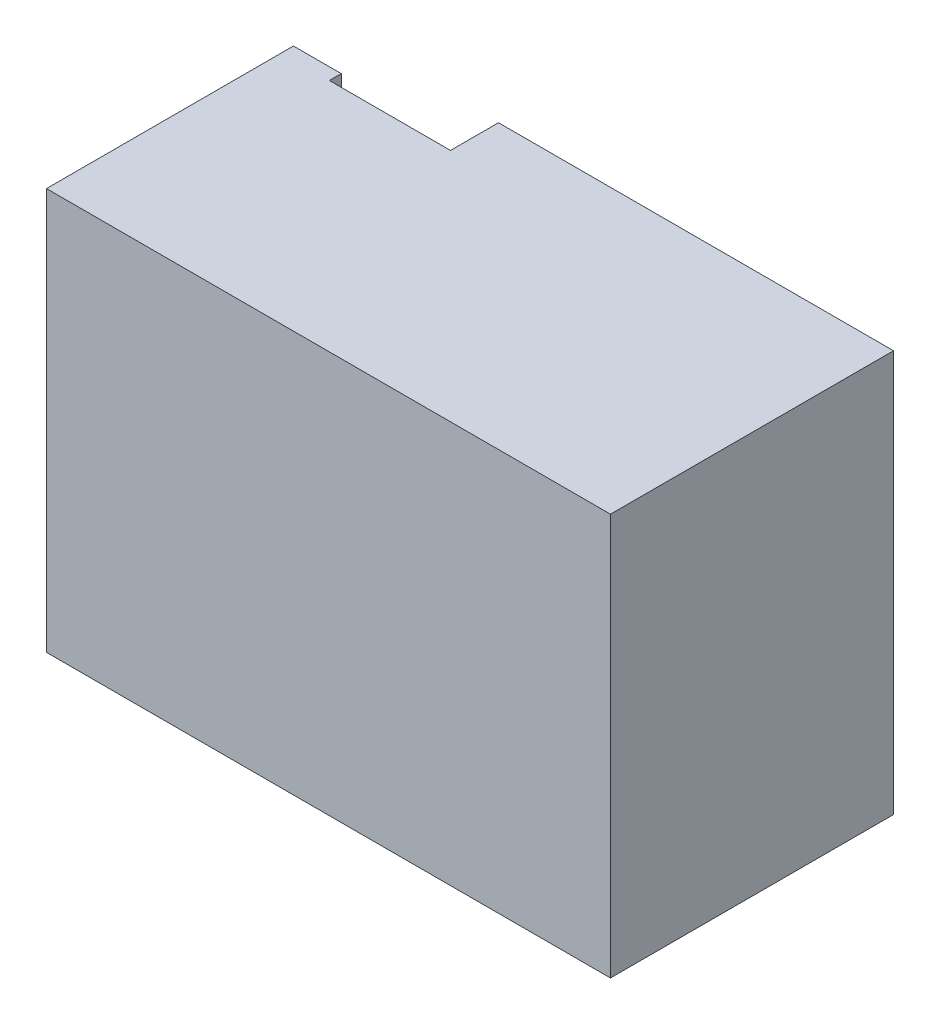
ISO-10303-21;
HEADER;
FILE_DESCRIPTION(('STEP AP214'),'2;1');
FILE_NAME('part.step','',(''),(''),'','','');
FILE_SCHEMA(('AUTOMOTIVE_DESIGN { 1 0 10303 214 1 1 1 1 }'));
ENDSEC;
DATA;
#1=APPLICATION_CONTEXT('core data for automotive mechanical design processes');
#2=APPLICATION_PROTOCOL_DEFINITION('international standard','automotive_design',2000,#1);
#3=PRODUCT_CONTEXT('',#1,'mechanical');
#4=PRODUCT('Part','Part','',(#3));
#5=PRODUCT_RELATED_PRODUCT_CATEGORY('part','',(#4));
#6=PRODUCT_DEFINITION_FORMATION('','',#4);
#7=PRODUCT_DEFINITION_CONTEXT('part definition',#1,'design');
#8=PRODUCT_DEFINITION('design','',#6,#7);
#9=PRODUCT_DEFINITION_SHAPE('','',#8);
#10=(LENGTH_UNIT() NAMED_UNIT(*) SI_UNIT(.MILLI.,.METRE.));
#11=(NAMED_UNIT(*) PLANE_ANGLE_UNIT() SI_UNIT($,.RADIAN.));
#12=(NAMED_UNIT(*) SI_UNIT($,.STERADIAN.) SOLID_ANGLE_UNIT());
#13=UNCERTAINTY_MEASURE_WITH_UNIT(LENGTH_MEASURE(1.E-05),#10,'distance_accuracy_value','');
#14=(GEOMETRIC_REPRESENTATION_CONTEXT(3) GLOBAL_UNCERTAINTY_ASSIGNED_CONTEXT((#13)) GLOBAL_UNIT_ASSIGNED_CONTEXT((#10,
#11,#12)) REPRESENTATION_CONTEXT('',''));
#15=CARTESIAN_POINT('',(0.,0.,0.));
#16=DIRECTION('',(0.,0.,1.));
#17=DIRECTION('',(1.,0.,0.));
#18=AXIS2_PLACEMENT_3D('',#15,#16,#17);
#19=CARTESIAN_POINT('',(72.306268293715,-48.3210427553595,43.5923082751366));
#20=DIRECTION('',(-1.,0.,0.));
#21=DIRECTION('',(0.,0.,1.));
#22=AXIS2_PLACEMENT_3D('',#19,#20,#21);
#23=PLANE('',#22);
#24=DIRECTION('',(0.,0.,-1.));
#25=VECTOR('',#24,1.);
#26=CARTESIAN_POINT('',(72.306268293715,59.6789572446405,43.5923082751366));
#27=LINE('',#26,#25);
#28=CARTESIAN_POINT('',(72.306268293715,59.6789572446405,81.5923082751366));
#29=VERTEX_POINT('',#28);
#30=CARTESIAN_POINT('',(72.306268293715,59.6789572446405,5.49230827513662));
#31=VERTEX_POINT('',#30);
#32=EDGE_CURVE('E11',#29,#31,#27,.T.);
#33=ORIENTED_EDGE('',*,*,#32,.F.);
#34=DIRECTION('',(0.,1.,0.));
#35=VECTOR('',#34,1.);
#36=CARTESIAN_POINT('',(72.306268293715,-48.3210427553595,81.5923082751366));
#37=LINE('',#36,#35);
#38=CARTESIAN_POINT('',(72.306268293715,-48.3210427553595,81.5923082751366));
#39=VERTEX_POINT('',#38);
#40=EDGE_CURVE('E98',#39,#29,#37,.T.);
#41=ORIENTED_EDGE('',*,*,#40,.F.);
#42=DIRECTION('',(0.,0.,-1.));
#43=VECTOR('',#42,1.);
#44=CARTESIAN_POINT('',(72.306268293715,-48.3210427553595,43.5923082751366));
#45=LINE('',#44,#43);
#46=CARTESIAN_POINT('',(72.306268293715,-48.3210427553595,5.49230827513662));
#47=VERTEX_POINT('',#46);
#48=EDGE_CURVE('E55',#39,#47,#45,.T.);
#49=ORIENTED_EDGE('',*,*,#48,.T.);
#50=DIRECTION('',(0.,1.,0.));
#51=VECTOR('',#50,1.);
#52=CARTESIAN_POINT('',(72.306268293715,-48.3210427553595,5.49230827513662));
#53=LINE('',#52,#51);
#54=EDGE_CURVE('E100',#47,#31,#53,.T.);
#55=ORIENTED_EDGE('',*,*,#54,.T.);
#56=EDGE_LOOP('',(#33,#41,#49,#55));
#57=FACE_BOUND('',#56,.T.);
#58=ADVANCED_FACE('F31',(#57),#23,.F.);
#59=CARTESIAN_POINT('',(72.306268293715,59.6789572446405,43.5923082751366));
#60=DIRECTION('',(0.,-1.,0.));
#61=DIRECTION('',(0.,0.,-1.));
#62=AXIS2_PLACEMENT_3D('',#59,#60,#61);
#63=PLANE('',#62);
#64=DIRECTION('',(0.,0.,-1.));
#65=VECTOR('',#64,1.);
#66=CARTESIAN_POINT('',(-79.3237317062851,59.6789572446405,43.5923082751366));
#67=LINE('',#66,#65);
#68=CARTESIAN_POINT('',(-79.3237317062851,59.6789572446405,81.5923082751366));
#69=VERTEX_POINT('',#68);
#70=CARTESIAN_POINT('',(-79.3237317062851,59.6789572446405,15.2023082751366));
#71=VERTEX_POINT('',#70);
#72=EDGE_CURVE('E108',#69,#71,#67,.T.);
#73=ORIENTED_EDGE('',*,*,#72,.F.);
#74=DIRECTION('',(-1.,0.,0.));
#75=VECTOR('',#74,1.);
#76=CARTESIAN_POINT('',(72.306268293715,59.6789572446405,81.5923082751366));
#77=LINE('',#76,#75);
#78=EDGE_CURVE('E105',#29,#69,#77,.T.);
#79=ORIENTED_EDGE('',*,*,#78,.F.);
#80=ORIENTED_EDGE('',*,*,#32,.T.);
#81=DIRECTION('',(-1.,0.,0.));
#82=VECTOR('',#81,1.);
#83=CARTESIAN_POINT('',(72.306268293715,59.6789572446405,5.49230827513662));
#84=LINE('',#83,#82);
#85=CARTESIAN_POINT('',(-33.8937317062851,59.6789572446405,5.49230827513662));
#86=VERTEX_POINT('',#85);
#87=EDGE_CURVE('E157',#31,#86,#84,.T.);
#88=ORIENTED_EDGE('',*,*,#87,.T.);
#89=DIRECTION('',(0.,0.,-1.));
#90=VECTOR('',#89,1.);
#91=CARTESIAN_POINT('',(-33.8937317062851,59.6789572446405,43.5923082751366));
#92=LINE('',#91,#90);
#93=CARTESIAN_POINT('',(-33.8937317062851,59.6789572446405,18.4023082751366));
#94=VERTEX_POINT('',#93);
#95=EDGE_CURVE('E40',#94,#86,#92,.T.);
#96=ORIENTED_EDGE('',*,*,#95,.F.);
#97=DIRECTION('',(1.,0.,0.));
#98=VECTOR('',#97,1.);
#99=CARTESIAN_POINT('',(-79.3237317062851,59.6789572446405,18.4023082751366));
#100=LINE('',#99,#98);
#101=CARTESIAN_POINT('',(-66.4637317062851,59.6789572446405,18.4023082751366));
#102=VERTEX_POINT('',#101);
#103=EDGE_CURVE('E34',#102,#94,#100,.T.);
#104=ORIENTED_EDGE('',*,*,#103,.F.);
#105=DIRECTION('',(0.,0.,1.));
#106=VECTOR('',#105,1.);
#107=CARTESIAN_POINT('',(-66.4637317062851,59.6789572446405,15.2023082751366));
#108=LINE('',#107,#106);
#109=CARTESIAN_POINT('',(-66.4637317062851,59.6789572446405,15.2023082751366));
#110=VERTEX_POINT('',#109);
#111=EDGE_CURVE('E137',#110,#102,#108,.T.);
#112=ORIENTED_EDGE('',*,*,#111,.F.);
#113=DIRECTION('',(1.,0.,0.));
#114=VECTOR('',#113,1.);
#115=CARTESIAN_POINT('',(-79.3237317062851,59.6789572446405,15.2023082751366));
#116=LINE('',#115,#114);
#117=EDGE_CURVE('E126',#71,#110,#116,.T.);
#118=ORIENTED_EDGE('',*,*,#117,.F.);
#119=EDGE_LOOP('',(#73,#79,#80,#88,#96,#104,#112,#118));
#120=FACE_BOUND('',#119,.T.);
#121=ADVANCED_FACE('F106',(#120),#63,.F.);
#122=CARTESIAN_POINT('',(72.306268293715,-48.3210427553595,43.5923082751366));
#123=DIRECTION('',(0.,1.,0.));
#124=DIRECTION('',(0.,0.,1.));
#125=AXIS2_PLACEMENT_3D('',#122,#123,#124);
#126=PLANE('',#125);
#127=ORIENTED_EDGE('',*,*,#48,.F.);
#128=DIRECTION('',(1.,0.,0.));
#129=VECTOR('',#128,1.);
#130=CARTESIAN_POINT('',(72.306268293715,-48.3210427553595,81.5923082751366));
#131=LINE('',#130,#129);
#132=CARTESIAN_POINT('',(-79.3237317062851,-48.3210427553595,81.5923082751366));
#133=VERTEX_POINT('',#132);
#134=EDGE_CURVE('E117',#133,#39,#131,.T.);
#135=ORIENTED_EDGE('',*,*,#134,.F.);
#136=DIRECTION('',(0.,0.,1.));
#137=VECTOR('',#136,1.);
#138=CARTESIAN_POINT('',(-79.3237317062851,-48.3210427553595,43.5923082751366));
#139=LINE('',#138,#137);
#140=CARTESIAN_POINT('',(-79.3237317062851,-48.3210427553595,15.2023082751366));
#141=VERTEX_POINT('',#140);
#142=EDGE_CURVE('E141',#141,#133,#139,.T.);
#143=ORIENTED_EDGE('',*,*,#142,.F.);
#144=DIRECTION('',(-1.,0.,0.));
#145=VECTOR('',#144,1.);
#146=CARTESIAN_POINT('',(-79.3237317062851,-48.3210427553595,15.2023082751366));
#147=LINE('',#146,#145);
#148=CARTESIAN_POINT('',(-66.4637317062851,-48.3210427553595,15.2023082751366));
#149=VERTEX_POINT('',#148);
#150=EDGE_CURVE('E130',#149,#141,#147,.T.);
#151=ORIENTED_EDGE('',*,*,#150,.F.);
#152=DIRECTION('',(0.,0.,1.));
#153=VECTOR('',#152,1.);
#154=CARTESIAN_POINT('',(-66.4637317062851,-48.3210427553595,15.2023082751366));
#155=LINE('',#154,#153);
#156=CARTESIAN_POINT('',(-66.4637317062851,-48.3210427553595,18.4023082751366));
#157=VERTEX_POINT('',#156);
#158=EDGE_CURVE('E133',#149,#157,#155,.T.);
#159=ORIENTED_EDGE('',*,*,#158,.T.);
#160=DIRECTION('',(1.,0.,0.));
#161=VECTOR('',#160,1.);
#162=CARTESIAN_POINT('',(-79.3237317062851,-48.3210427553595,18.4023082751366));
#163=LINE('',#162,#161);
#164=CARTESIAN_POINT('',(-33.8937317062851,-48.3210427553595,18.4023082751366));
#165=VERTEX_POINT('',#164);
#166=EDGE_CURVE('E143',#157,#165,#163,.T.);
#167=ORIENTED_EDGE('',*,*,#166,.T.);
#168=DIRECTION('',(0.,0.,-1.));
#169=VECTOR('',#168,1.);
#170=CARTESIAN_POINT('',(-33.8937317062851,-48.3210427553595,43.5923082751366));
#171=LINE('',#170,#169);
#172=CARTESIAN_POINT('',(-33.8937317062851,-48.3210427553595,5.49230827513662));
#173=VERTEX_POINT('',#172);
#174=EDGE_CURVE('E167',#165,#173,#171,.T.);
#175=ORIENTED_EDGE('',*,*,#174,.T.);
#176=DIRECTION('',(1.,0.,0.));
#177=VECTOR('',#176,1.);
#178=CARTESIAN_POINT('',(72.306268293715,-48.3210427553595,5.49230827513662));
#179=LINE('',#178,#177);
#180=EDGE_CURVE('E162',#173,#47,#179,.T.);
#181=ORIENTED_EDGE('',*,*,#180,.T.);
#182=EDGE_LOOP('',(#127,#135,#143,#151,#159,#167,#175,#181));
#183=FACE_BOUND('',#182,.T.);
#184=ADVANCED_FACE('F184',(#183),#126,.F.);
#185=CARTESIAN_POINT('',(-79.3237317062851,59.6789572446405,43.5923082751366));
#186=DIRECTION('',(-1.,0.,0.));
#187=DIRECTION('',(0.,0.,1.));
#188=AXIS2_PLACEMENT_3D('',#185,#186,#187);
#189=PLANE('',#188);
#190=ORIENTED_EDGE('',*,*,#142,.T.);
#191=DIRECTION('',(0.,-1.,0.));
#192=VECTOR('',#191,1.);
#193=CARTESIAN_POINT('',(-79.3237317062851,-48.3210427553595,81.5923082751366));
#194=LINE('',#193,#192);
#195=EDGE_CURVE('E112',#69,#133,#194,.T.);
#196=ORIENTED_EDGE('',*,*,#195,.F.);
#197=ORIENTED_EDGE('',*,*,#72,.T.);
#198=DIRECTION('',(0.,1.,0.));
#199=VECTOR('',#198,1.);
#200=CARTESIAN_POINT('',(-79.3237317062851,-48.3210427553595,15.2023082751366));
#201=LINE('',#200,#199);
#202=EDGE_CURVE('E123',#141,#71,#201,.T.);
#203=ORIENTED_EDGE('',*,*,#202,.F.);
#204=EDGE_LOOP('',(#190,#196,#197,#203));
#205=FACE_BOUND('',#204,.T.);
#206=ADVANCED_FACE('F183',(#205),#189,.T.);
#207=CARTESIAN_POINT('',(-79.3237317062851,-48.3210427553595,18.4023082751366));
#208=DIRECTION('',(0.,0.,1.));
#209=DIRECTION('',(1.,0.,0.));
#210=AXIS2_PLACEMENT_3D('',#207,#208,#209);
#211=PLANE('',#210);
#212=DIRECTION('',(0.,-1.,0.));
#213=VECTOR('',#212,1.);
#214=CARTESIAN_POINT('',(-66.4637317062851,-48.3210427553595,18.4023082751366));
#215=LINE('',#214,#213);
#216=EDGE_CURVE('E122',#102,#157,#215,.T.);
#217=ORIENTED_EDGE('',*,*,#216,.F.);
#218=ORIENTED_EDGE('',*,*,#103,.T.);
#219=DIRECTION('',(0.,-1.,0.));
#220=VECTOR('',#219,1.);
#221=CARTESIAN_POINT('',(-33.8937317062851,-48.3210427553595,18.4023082751366));
#222=LINE('',#221,#220);
#223=EDGE_CURVE('E139',#94,#165,#222,.T.);
#224=ORIENTED_EDGE('',*,*,#223,.T.);
#225=ORIENTED_EDGE('',*,*,#166,.F.);
#226=EDGE_LOOP('',(#217,#218,#224,#225));
#227=FACE_BOUND('',#226,.T.);
#228=ADVANCED_FACE('F194',(#227),#211,.F.);
#229=CARTESIAN_POINT('',(-33.8937317062851,-48.3210427553595,43.5923082751366));
#230=DIRECTION('',(1.,0.,0.));
#231=DIRECTION('',(0.,0.,-1.));
#232=AXIS2_PLACEMENT_3D('',#229,#230,#231);
#233=PLANE('',#232);
#234=ORIENTED_EDGE('',*,*,#223,.F.);
#235=ORIENTED_EDGE('',*,*,#95,.T.);
#236=DIRECTION('',(0.,-1.,0.));
#237=VECTOR('',#236,1.);
#238=CARTESIAN_POINT('',(-33.8937317062851,-48.3210427553595,5.49230827513662));
#239=LINE('',#238,#237);
#240=EDGE_CURVE('E158',#86,#173,#239,.T.);
#241=ORIENTED_EDGE('',*,*,#240,.T.);
#242=ORIENTED_EDGE('',*,*,#174,.F.);
#243=EDGE_LOOP('',(#234,#235,#241,#242));
#244=FACE_BOUND('',#243,.T.);
#245=ADVANCED_FACE('F171',(#244),#233,.F.);
#246=CARTESIAN_POINT('',(72.306268293715,59.6789572446405,5.49230827513662));
#247=DIRECTION('',(0.,0.,1.));
#248=DIRECTION('',(1.,0.,0.));
#249=AXIS2_PLACEMENT_3D('',#246,#247,#248);
#250=PLANE('',#249);
#251=ORIENTED_EDGE('',*,*,#54,.F.);
#252=ORIENTED_EDGE('',*,*,#180,.F.);
#253=ORIENTED_EDGE('',*,*,#240,.F.);
#254=ORIENTED_EDGE('',*,*,#87,.F.);
#255=EDGE_LOOP('',(#251,#252,#253,#254));
#256=FACE_BOUND('',#255,.T.);
#257=ADVANCED_FACE('F186',(#256),#250,.F.);
#258=CARTESIAN_POINT('',(-66.4637317062851,-48.3210427553595,15.2023082751366));
#259=DIRECTION('',(-1.,0.,0.));
#260=DIRECTION('',(0.,0.,1.));
#261=AXIS2_PLACEMENT_3D('',#258,#259,#260);
#262=PLANE('',#261);
#263=ORIENTED_EDGE('',*,*,#216,.T.);
#264=ORIENTED_EDGE('',*,*,#158,.F.);
#265=DIRECTION('',(0.,-1.,0.));
#266=VECTOR('',#265,1.);
#267=CARTESIAN_POINT('',(-66.4637317062851,-48.3210427553595,15.2023082751366));
#268=LINE('',#267,#266);
#269=EDGE_CURVE('E128',#110,#149,#268,.T.);
#270=ORIENTED_EDGE('',*,*,#269,.F.);
#271=ORIENTED_EDGE('',*,*,#111,.T.);
#272=EDGE_LOOP('',(#263,#264,#270,#271));
#273=FACE_BOUND('',#272,.T.);
#274=ADVANCED_FACE('F177',(#273),#262,.F.);
#275=CARTESIAN_POINT('',(-79.3237317062851,59.6789572446405,15.2023082751366));
#276=DIRECTION('',(0.,0.,-1.));
#277=DIRECTION('',(-1.,0.,0.));
#278=AXIS2_PLACEMENT_3D('',#275,#276,#277);
#279=PLANE('',#278);
#280=ORIENTED_EDGE('',*,*,#202,.T.);
#281=ORIENTED_EDGE('',*,*,#117,.T.);
#282=ORIENTED_EDGE('',*,*,#269,.T.);
#283=ORIENTED_EDGE('',*,*,#150,.T.);
#284=EDGE_LOOP('',(#280,#281,#282,#283));
#285=FACE_BOUND('',#284,.T.);
#286=ADVANCED_FACE('F180',(#285),#279,.T.);
#287=CARTESIAN_POINT('',(72.306268293715,59.6789572446405,81.5923082751366));
#288=DIRECTION('',(0.,0.,1.));
#289=DIRECTION('',(1.,0.,0.));
#290=AXIS2_PLACEMENT_3D('',#287,#288,#289);
#291=PLANE('',#290);
#292=ORIENTED_EDGE('',*,*,#40,.T.);
#293=ORIENTED_EDGE('',*,*,#78,.T.);
#294=ORIENTED_EDGE('',*,*,#195,.T.);
#295=ORIENTED_EDGE('',*,*,#134,.T.);
#296=EDGE_LOOP('',(#292,#293,#294,#295));
#297=FACE_BOUND('',#296,.T.);
#298=ADVANCED_FACE('F115',(#297),#291,.T.);
#299=CLOSED_SHELL('',(#58,#121,#184,#206,#228,#245,#257,#274,#286,#298));
#300=MANIFOLD_SOLID_BREP('B2',#299);
#301=ADVANCED_BREP_SHAPE_REPRESENTATION('',(#18,#300),#14);
#302=SHAPE_DEFINITION_REPRESENTATION(#9,#301);
ENDSEC;
END-ISO-10303-21;
